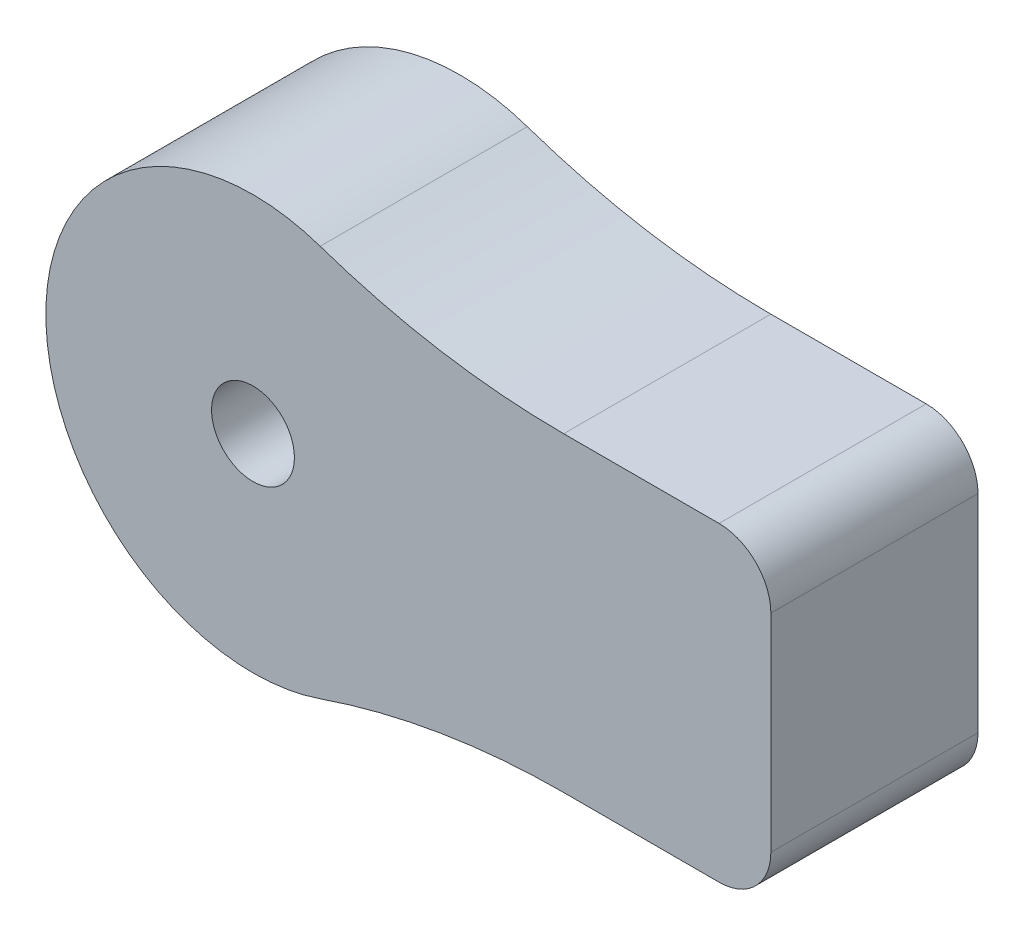
ISO-10303-21;
HEADER;
FILE_DESCRIPTION(('STEP AP214'),'2;1');
FILE_NAME('part.step','',(''),(''),'','','');
FILE_SCHEMA(('AUTOMOTIVE_DESIGN { 1 0 10303 214 1 1 1 1 }'));
ENDSEC;
DATA;
#1=APPLICATION_CONTEXT('core data for automotive mechanical design processes');
#2=APPLICATION_PROTOCOL_DEFINITION('international standard','automotive_design',2000,#1);
#3=PRODUCT_CONTEXT('',#1,'mechanical');
#4=PRODUCT('Part','Part','',(#3));
#5=PRODUCT_RELATED_PRODUCT_CATEGORY('part','',(#4));
#6=PRODUCT_DEFINITION_FORMATION('','',#4);
#7=PRODUCT_DEFINITION_CONTEXT('part definition',#1,'design');
#8=PRODUCT_DEFINITION('design','',#6,#7);
#9=PRODUCT_DEFINITION_SHAPE('','',#8);
#10=(LENGTH_UNIT() NAMED_UNIT(*) SI_UNIT(.MILLI.,.METRE.));
#11=(NAMED_UNIT(*) PLANE_ANGLE_UNIT() SI_UNIT($,.RADIAN.));
#12=(NAMED_UNIT(*) SI_UNIT($,.STERADIAN.) SOLID_ANGLE_UNIT());
#13=UNCERTAINTY_MEASURE_WITH_UNIT(LENGTH_MEASURE(1.E-05),#10,'distance_accuracy_value','');
#14=(GEOMETRIC_REPRESENTATION_CONTEXT(3) GLOBAL_UNCERTAINTY_ASSIGNED_CONTEXT((#13)) GLOBAL_UNIT_ASSIGNED_CONTEXT((#10,
#11,#12)) REPRESENTATION_CONTEXT('',''));
#15=CARTESIAN_POINT('',(0.,0.,0.));
#16=DIRECTION('',(0.,0.,1.));
#17=DIRECTION('',(1.,0.,0.));
#18=AXIS2_PLACEMENT_3D('',#15,#16,#17);
#19=CARTESIAN_POINT('',(11.1125,6.35,6.35));
#20=DIRECTION('',(-1.,0.,0.));
#21=DIRECTION('',(0.,0.,1.));
#22=AXIS2_PLACEMENT_3D('',#19,#20,#21);
#23=PLANE('',#22);
#24=DIRECTION('',(0.,1.,0.));
#25=VECTOR('',#24,1.);
#26=CARTESIAN_POINT('',(11.1125,6.35,6.35));
#27=LINE('',#26,#25);
#28=CARTESIAN_POINT('',(11.1125,-3.175,6.35));
#29=VERTEX_POINT('',#28);
#30=CARTESIAN_POINT('',(11.1125,3.175,6.35));
#31=VERTEX_POINT('',#30);
#32=EDGE_CURVE('E144',#29,#31,#27,.T.);
#33=ORIENTED_EDGE('',*,*,#32,.F.);
#34=DIRECTION('',(0.,0.,1.));
#35=VECTOR('',#34,1.);
#36=CARTESIAN_POINT('',(11.1125,-3.175,0.));
#37=LINE('',#36,#35);
#38=CARTESIAN_POINT('',(11.1125,-3.175,0.));
#39=VERTEX_POINT('',#38);
#40=EDGE_CURVE('E161',#29,#39,#37,.F.);
#41=ORIENTED_EDGE('',*,*,#40,.T.);
#42=DIRECTION('',(0.,1.,0.));
#43=VECTOR('',#42,1.);
#44=CARTESIAN_POINT('',(11.1125,6.35,0.));
#45=LINE('',#44,#43);
#46=CARTESIAN_POINT('',(11.1125,3.175,0.));
#47=VERTEX_POINT('',#46);
#48=EDGE_CURVE('E141',#39,#47,#45,.T.);
#49=ORIENTED_EDGE('',*,*,#48,.T.);
#50=DIRECTION('',(0.,0.,1.));
#51=VECTOR('',#50,1.);
#52=CARTESIAN_POINT('',(11.1125,3.175,6.35));
#53=LINE('',#52,#51);
#54=EDGE_CURVE('E158',#47,#31,#53,.T.);
#55=ORIENTED_EDGE('',*,*,#54,.T.);
#56=EDGE_LOOP('',(#33,#41,#49,#55));
#57=FACE_BOUND('',#56,.T.);
#58=ADVANCED_FACE('F34',(#57),#23,.F.);
#59=CARTESIAN_POINT('',(0.,0.,6.35));
#60=DIRECTION('',(0.,0.,1.));
#61=DIRECTION('',(1.,0.,0.));
#62=AXIS2_PLACEMENT_3D('',#59,#60,#61);
#63=PLANE('',#62);
#64=CARTESIAN_POINT('',(-4.76249999999998,0.,6.35));
#65=DIRECTION('',(0.,0.,1.));
#66=DIRECTION('',(1.,0.,0.));
#67=AXIS2_PLACEMENT_3D('',#64,#65,#66);
#68=CIRCLE('',#67,1.27);
#69=CARTESIAN_POINT('',(-3.49249999999998,0.,6.35));
#70=VERTEX_POINT('',#69);
#71=EDGE_CURVE('E135',#70,#70,#68,.T.);
#72=ORIENTED_EDGE('',*,*,#71,.F.);
#73=EDGE_LOOP('',(#72));
#74=FACE_BOUND('',#73,.T.);
#75=DIRECTION('',(1.,0.,0.));
#76=VECTOR('',#75,1.);
#77=CARTESIAN_POINT('',(4.76250000000001,-4.7625,6.35));
#78=LINE('',#77,#76);
#79=CARTESIAN_POINT('',(4.76250000000001,-4.7625,6.35));
#80=VERTEX_POINT('',#79);
#81=CARTESIAN_POINT('',(9.52500000000001,-4.7625,6.35));
#82=VERTEX_POINT('',#81);
#83=EDGE_CURVE('E128',#80,#82,#78,.T.);
#84=ORIENTED_EDGE('',*,*,#83,.T.);
#85=CARTESIAN_POINT('',(9.52500000000001,-3.175,6.35));
#86=DIRECTION('',(0.,0.,1.));
#87=DIRECTION('',(1.,0.,0.));
#88=AXIS2_PLACEMENT_3D('',#85,#86,#87);
#89=CIRCLE('',#88,1.5875);
#90=EDGE_CURVE('E156',#82,#29,#89,.T.);
#91=ORIENTED_EDGE('',*,*,#90,.T.);
#92=ORIENTED_EDGE('',*,*,#32,.T.);
#93=CARTESIAN_POINT('',(9.52500000000001,3.175,6.35));
#94=DIRECTION('',(0.,0.,1.));
#95=DIRECTION('',(1.,0.,0.));
#96=AXIS2_PLACEMENT_3D('',#93,#94,#95);
#97=CIRCLE('',#96,1.5875);
#98=CARTESIAN_POINT('',(9.52500000000001,4.7625,6.35));
#99=VERTEX_POINT('',#98);
#100=EDGE_CURVE('E154',#31,#99,#97,.T.);
#101=ORIENTED_EDGE('',*,*,#100,.T.);
#102=DIRECTION('',(-1.,0.,0.));
#103=VECTOR('',#102,1.);
#104=CARTESIAN_POINT('',(4.76250000000001,4.7625,6.35));
#105=LINE('',#104,#103);
#106=CARTESIAN_POINT('',(4.76250000000001,4.7625,6.35));
#107=VERTEX_POINT('',#106);
#108=EDGE_CURVE('E131',#99,#107,#105,.T.);
#109=ORIENTED_EDGE('',*,*,#108,.T.);
#110=CARTESIAN_POINT('',(4.76250000000001,27.78125,6.35));
#111=DIRECTION('',(0.,0.,-1.));
#112=DIRECTION('',(1.,0.,0.));
#113=AXIS2_PLACEMENT_3D('',#110,#111,#112);
#114=CIRCLE('',#113,23.01875);
#115=CARTESIAN_POINT('',(-2.70304054054053,6.00675675675676,6.35));
#116=VERTEX_POINT('',#115);
#117=EDGE_CURVE('E111',#107,#116,#114,.T.);
#118=ORIENTED_EDGE('',*,*,#117,.T.);
#119=CARTESIAN_POINT('',(-4.76249999999998,0.,6.35));
#120=DIRECTION('',(0.,0.,1.));
#121=DIRECTION('',(1.,0.,0.));
#122=AXIS2_PLACEMENT_3D('',#119,#120,#121);
#123=CIRCLE('',#122,6.35);
#124=CARTESIAN_POINT('',(-2.70304054054053,-6.00675675675676,6.35));
#125=VERTEX_POINT('',#124);
#126=EDGE_CURVE('E149',#116,#125,#123,.T.);
#127=ORIENTED_EDGE('',*,*,#126,.T.);
#128=CARTESIAN_POINT('',(4.76250000000001,-27.78125,6.35));
#129=DIRECTION('',(0.,0.,-1.));
#130=DIRECTION('',(-1.,0.,0.));
#131=AXIS2_PLACEMENT_3D('',#128,#129,#130);
#132=CIRCLE('',#131,23.01875);
#133=EDGE_CURVE('E125',#125,#80,#132,.T.);
#134=ORIENTED_EDGE('',*,*,#133,.T.);
#135=EDGE_LOOP('',(#84,#91,#92,#101,#109,#118,#127,#134));
#136=FACE_BOUND('',#135,.T.);
#137=ADVANCED_FACE('F176',(#74,#136),#63,.T.);
#138=CARTESIAN_POINT('',(0.,0.,0.));
#139=DIRECTION('',(0.,0.,1.));
#140=DIRECTION('',(1.,0.,0.));
#141=AXIS2_PLACEMENT_3D('',#138,#139,#140);
#142=PLANE('',#141);
#143=CARTESIAN_POINT('',(-4.76249999999998,0.,0.));
#144=DIRECTION('',(0.,0.,1.));
#145=DIRECTION('',(1.,0.,0.));
#146=AXIS2_PLACEMENT_3D('',#143,#144,#145);
#147=CIRCLE('',#146,1.27);
#148=CARTESIAN_POINT('',(-3.49249999999998,0.,0.));
#149=VERTEX_POINT('',#148);
#150=EDGE_CURVE('E138',#149,#149,#147,.T.);
#151=ORIENTED_EDGE('',*,*,#150,.T.);
#152=EDGE_LOOP('',(#151));
#153=FACE_BOUND('',#152,.T.);
#154=ORIENTED_EDGE('',*,*,#48,.F.);
#155=CARTESIAN_POINT('',(9.52500000000001,-3.175,0.));
#156=DIRECTION('',(0.,0.,1.));
#157=DIRECTION('',(1.,0.,0.));
#158=AXIS2_PLACEMENT_3D('',#155,#156,#157);
#159=CIRCLE('',#158,1.5875);
#160=CARTESIAN_POINT('',(9.52500000000001,-4.7625,0.));
#161=VERTEX_POINT('',#160);
#162=EDGE_CURVE('E42',#39,#161,#159,.F.);
#163=ORIENTED_EDGE('',*,*,#162,.T.);
#164=DIRECTION('',(1.,0.,0.));
#165=VECTOR('',#164,1.);
#166=CARTESIAN_POINT('',(4.76250000000001,-4.7625,0.));
#167=LINE('',#166,#165);
#168=CARTESIAN_POINT('',(4.76250000000001,-4.7625,0.));
#169=VERTEX_POINT('',#168);
#170=EDGE_CURVE('E104',#169,#161,#167,.T.);
#171=ORIENTED_EDGE('',*,*,#170,.F.);
#172=CARTESIAN_POINT('',(4.76250000000001,-27.78125,0.));
#173=DIRECTION('',(0.,0.,-1.));
#174=DIRECTION('',(-1.,0.,0.));
#175=AXIS2_PLACEMENT_3D('',#172,#173,#174);
#176=CIRCLE('',#175,23.01875);
#177=CARTESIAN_POINT('',(-2.70304054054053,-6.00675675675676,0.));
#178=VERTEX_POINT('',#177);
#179=EDGE_CURVE('E134',#178,#169,#176,.T.);
#180=ORIENTED_EDGE('',*,*,#179,.F.);
#181=CARTESIAN_POINT('',(-4.76249999999998,0.,0.));
#182=DIRECTION('',(0.,0.,1.));
#183=DIRECTION('',(1.,0.,0.));
#184=AXIS2_PLACEMENT_3D('',#181,#182,#183);
#185=CIRCLE('',#184,6.35);
#186=CARTESIAN_POINT('',(-2.70304054054053,6.00675675675676,0.));
#187=VERTEX_POINT('',#186);
#188=EDGE_CURVE('E117',#178,#187,#185,.F.);
#189=ORIENTED_EDGE('',*,*,#188,.T.);
#190=CARTESIAN_POINT('',(4.76250000000001,27.78125,0.));
#191=DIRECTION('',(0.,0.,-1.));
#192=DIRECTION('',(1.,0.,0.));
#193=AXIS2_PLACEMENT_3D('',#190,#191,#192);
#194=CIRCLE('',#193,23.01875);
#195=CARTESIAN_POINT('',(4.76250000000001,4.7625,0.));
#196=VERTEX_POINT('',#195);
#197=EDGE_CURVE('E103',#196,#187,#194,.T.);
#198=ORIENTED_EDGE('',*,*,#197,.F.);
#199=DIRECTION('',(-1.,0.,0.));
#200=VECTOR('',#199,1.);
#201=CARTESIAN_POINT('',(4.76250000000001,4.7625,0.));
#202=LINE('',#201,#200);
#203=CARTESIAN_POINT('',(9.52500000000001,4.7625,0.));
#204=VERTEX_POINT('',#203);
#205=EDGE_CURVE('E97',#204,#196,#202,.T.);
#206=ORIENTED_EDGE('',*,*,#205,.F.);
#207=CARTESIAN_POINT('',(9.52500000000001,3.175,0.));
#208=DIRECTION('',(0.,0.,1.));
#209=DIRECTION('',(1.,0.,0.));
#210=AXIS2_PLACEMENT_3D('',#207,#208,#209);
#211=CIRCLE('',#210,1.5875);
#212=EDGE_CURVE('E54',#204,#47,#211,.F.);
#213=ORIENTED_EDGE('',*,*,#212,.T.);
#214=EDGE_LOOP('',(#154,#163,#171,#180,#189,#198,#206,#213));
#215=FACE_BOUND('',#214,.T.);
#216=ADVANCED_FACE('F115',(#153,#215),#142,.F.);
#217=CARTESIAN_POINT('',(-4.76249999999998,0.,0.));
#218=DIRECTION('',(0.,0.,-1.));
#219=DIRECTION('',(-1.,0.,0.));
#220=AXIS2_PLACEMENT_3D('',#217,#218,#219);
#221=CYLINDRICAL_SURFACE('',#220,6.35);
#222=ORIENTED_EDGE('',*,*,#126,.F.);
#223=DIRECTION('',(0.,0.,1.));
#224=VECTOR('',#223,1.);
#225=CARTESIAN_POINT('',(-2.70304054054053,6.00675675675676,0.));
#226=LINE('',#225,#224);
#227=EDGE_CURVE('E112',#187,#116,#226,.T.);
#228=ORIENTED_EDGE('',*,*,#227,.F.);
#229=ORIENTED_EDGE('',*,*,#188,.F.);
#230=DIRECTION('',(0.,0.,1.));
#231=VECTOR('',#230,1.);
#232=CARTESIAN_POINT('',(-2.70304054054053,-6.00675675675676,0.));
#233=LINE('',#232,#231);
#234=EDGE_CURVE('E119',#178,#125,#233,.T.);
#235=ORIENTED_EDGE('',*,*,#234,.T.);
#236=EDGE_LOOP('',(#222,#228,#229,#235));
#237=FACE_BOUND('',#236,.T.);
#238=ADVANCED_FACE('F183',(#237),#221,.T.);
#239=CARTESIAN_POINT('',(-4.76249999999998,0.,0.));
#240=DIRECTION('',(0.,0.,1.));
#241=DIRECTION('',(1.,0.,0.));
#242=AXIS2_PLACEMENT_3D('',#239,#240,#241);
#243=CYLINDRICAL_SURFACE('',#242,1.27);
#244=ORIENTED_EDGE('',*,*,#150,.F.);
#245=EDGE_LOOP('',(#244));
#246=FACE_BOUND('',#245,.T.);
#247=ORIENTED_EDGE('',*,*,#71,.T.);
#248=EDGE_LOOP('',(#247));
#249=FACE_BOUND('',#248,.T.);
#250=ADVANCED_FACE('F188',(#246,#249),#243,.F.);
#251=CARTESIAN_POINT('',(4.76250000000001,-27.78125,0.));
#252=DIRECTION('',(0.,0.,1.));
#253=DIRECTION('',(1.,0.,0.));
#254=AXIS2_PLACEMENT_3D('',#251,#252,#253);
#255=CYLINDRICAL_SURFACE('',#254,23.01875);
#256=ORIENTED_EDGE('',*,*,#133,.F.);
#257=ORIENTED_EDGE('',*,*,#234,.F.);
#258=ORIENTED_EDGE('',*,*,#179,.T.);
#259=DIRECTION('',(0.,0.,1.));
#260=VECTOR('',#259,1.);
#261=CARTESIAN_POINT('',(4.76250000000001,-4.7625,0.));
#262=LINE('',#261,#260);
#263=EDGE_CURVE('E113',#169,#80,#262,.T.);
#264=ORIENTED_EDGE('',*,*,#263,.T.);
#265=EDGE_LOOP('',(#256,#257,#258,#264));
#266=FACE_BOUND('',#265,.T.);
#267=ADVANCED_FACE('F185',(#266),#255,.F.);
#268=CARTESIAN_POINT('',(4.76250000000001,-4.7625,0.));
#269=DIRECTION('',(0.,-1.,0.));
#270=DIRECTION('',(1.,0.,0.));
#271=AXIS2_PLACEMENT_3D('',#268,#269,#270);
#272=PLANE('',#271);
#273=ORIENTED_EDGE('',*,*,#170,.T.);
#274=DIRECTION('',(0.,0.,1.));
#275=VECTOR('',#274,1.);
#276=CARTESIAN_POINT('',(9.52500000000001,-4.7625,6.35));
#277=LINE('',#276,#275);
#278=EDGE_CURVE('E151',#161,#82,#277,.T.);
#279=ORIENTED_EDGE('',*,*,#278,.T.);
#280=ORIENTED_EDGE('',*,*,#83,.F.);
#281=ORIENTED_EDGE('',*,*,#263,.F.);
#282=EDGE_LOOP('',(#273,#279,#280,#281));
#283=FACE_BOUND('',#282,.T.);
#284=ADVANCED_FACE('F170',(#283),#272,.T.);
#285=CARTESIAN_POINT('',(4.76250000000001,27.78125,0.));
#286=DIRECTION('',(0.,0.,1.));
#287=DIRECTION('',(1.,0.,0.));
#288=AXIS2_PLACEMENT_3D('',#285,#286,#287);
#289=CYLINDRICAL_SURFACE('',#288,23.01875);
#290=ORIENTED_EDGE('',*,*,#117,.F.);
#291=DIRECTION('',(0.,0.,1.));
#292=VECTOR('',#291,1.);
#293=CARTESIAN_POINT('',(4.76250000000001,4.7625,0.));
#294=LINE('',#293,#292);
#295=EDGE_CURVE('E100',#196,#107,#294,.T.);
#296=ORIENTED_EDGE('',*,*,#295,.F.);
#297=ORIENTED_EDGE('',*,*,#197,.T.);
#298=ORIENTED_EDGE('',*,*,#227,.T.);
#299=EDGE_LOOP('',(#290,#296,#297,#298));
#300=FACE_BOUND('',#299,.T.);
#301=ADVANCED_FACE('F108',(#300),#289,.F.);
#302=CARTESIAN_POINT('',(4.76250000000001,4.7625,0.));
#303=DIRECTION('',(0.,1.,0.));
#304=DIRECTION('',(-1.,0.,0.));
#305=AXIS2_PLACEMENT_3D('',#302,#303,#304);
#306=PLANE('',#305);
#307=ORIENTED_EDGE('',*,*,#108,.F.);
#308=DIRECTION('',(0.,0.,1.));
#309=VECTOR('',#308,1.);
#310=CARTESIAN_POINT('',(9.52500000000001,4.7625,0.));
#311=LINE('',#310,#309);
#312=EDGE_CURVE('E12',#99,#204,#311,.F.);
#313=ORIENTED_EDGE('',*,*,#312,.T.);
#314=ORIENTED_EDGE('',*,*,#205,.T.);
#315=ORIENTED_EDGE('',*,*,#295,.T.);
#316=EDGE_LOOP('',(#307,#313,#314,#315));
#317=FACE_BOUND('',#316,.T.);
#318=ADVANCED_FACE('F99',(#317),#306,.T.);
#319=CARTESIAN_POINT('',(9.52500000000001,-3.175,0.));
#320=DIRECTION('',(0.,0.,-1.));
#321=DIRECTION('',(-1.,0.,0.));
#322=AXIS2_PLACEMENT_3D('',#319,#320,#321);
#323=CYLINDRICAL_SURFACE('',#322,1.5875);
#324=ORIENTED_EDGE('',*,*,#162,.F.);
#325=ORIENTED_EDGE('',*,*,#40,.F.);
#326=ORIENTED_EDGE('',*,*,#90,.F.);
#327=ORIENTED_EDGE('',*,*,#278,.F.);
#328=EDGE_LOOP('',(#324,#325,#326,#327));
#329=FACE_BOUND('',#328,.T.);
#330=ADVANCED_FACE('F173',(#329),#323,.T.);
#331=CARTESIAN_POINT('',(9.52500000000001,3.175,6.35));
#332=DIRECTION('',(0.,0.,-1.));
#333=DIRECTION('',(-1.,0.,0.));
#334=AXIS2_PLACEMENT_3D('',#331,#332,#333);
#335=CYLINDRICAL_SURFACE('',#334,1.5875);
#336=ORIENTED_EDGE('',*,*,#212,.F.);
#337=ORIENTED_EDGE('',*,*,#312,.F.);
#338=ORIENTED_EDGE('',*,*,#100,.F.);
#339=ORIENTED_EDGE('',*,*,#54,.F.);
#340=EDGE_LOOP('',(#336,#337,#338,#339));
#341=FACE_BOUND('',#340,.T.);
#342=ADVANCED_FACE('F36',(#341),#335,.T.);
#343=CLOSED_SHELL('',(#58,#137,#216,#238,#250,#267,#284,#301,#318,#330,#342));
#344=MANIFOLD_SOLID_BREP('B2',#343);
#345=ADVANCED_BREP_SHAPE_REPRESENTATION('',(#18,#344),#14);
#346=SHAPE_DEFINITION_REPRESENTATION(#9,#345);
ENDSEC;
END-ISO-10303-21;
